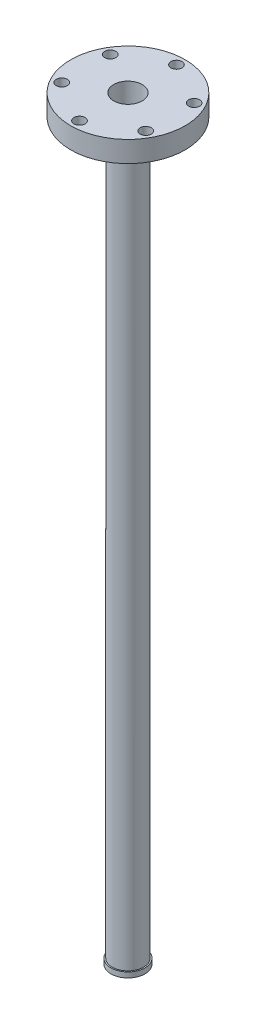
ISO-10303-21;
HEADER;
FILE_DESCRIPTION(('STEP AP214'),'2;1');
FILE_NAME('part.step','',(''),(''),'','','');
FILE_SCHEMA(('AUTOMOTIVE_DESIGN { 1 0 10303 214 1 1 1 1 }'));
ENDSEC;
DATA;
#1=APPLICATION_CONTEXT('core data for automotive mechanical design processes');
#2=APPLICATION_PROTOCOL_DEFINITION('international standard','automotive_design',2000,#1);
#3=PRODUCT_CONTEXT('',#1,'mechanical');
#4=PRODUCT('Part','Part','',(#3));
#5=PRODUCT_RELATED_PRODUCT_CATEGORY('part','',(#4));
#6=PRODUCT_DEFINITION_FORMATION('','',#4);
#7=PRODUCT_DEFINITION_CONTEXT('part definition',#1,'design');
#8=PRODUCT_DEFINITION('design','',#6,#7);
#9=PRODUCT_DEFINITION_SHAPE('','',#8);
#10=(LENGTH_UNIT() NAMED_UNIT(*) SI_UNIT(.MILLI.,.METRE.));
#11=(NAMED_UNIT(*) PLANE_ANGLE_UNIT() SI_UNIT($,.RADIAN.));
#12=(NAMED_UNIT(*) SI_UNIT($,.STERADIAN.) SOLID_ANGLE_UNIT());
#13=UNCERTAINTY_MEASURE_WITH_UNIT(LENGTH_MEASURE(1.E-05),#10,'distance_accuracy_value','');
#14=(GEOMETRIC_REPRESENTATION_CONTEXT(3) GLOBAL_UNCERTAINTY_ASSIGNED_CONTEXT((#13)) GLOBAL_UNIT_ASSIGNED_CONTEXT((#10,
#11,#12)) REPRESENTATION_CONTEXT('',''));
#15=CARTESIAN_POINT('',(0.,0.,0.));
#16=DIRECTION('',(0.,0.,1.));
#17=DIRECTION('',(1.,0.,0.));
#18=AXIS2_PLACEMENT_3D('',#15,#16,#17);
#19=CARTESIAN_POINT('',(0.,457.2,0.));
#20=DIRECTION('',(0.,-1.,0.));
#21=DIRECTION('',(0.,0.,-1.));
#22=AXIS2_PLACEMENT_3D('',#19,#20,#21);
#23=CYLINDRICAL_SURFACE('',#22,9.525);
#24=CARTESIAN_POINT('',(0.,444.5,0.));
#25=DIRECTION('',(0.,1.,0.));
#26=DIRECTION('',(0.,0.,1.));
#27=AXIS2_PLACEMENT_3D('',#24,#25,#26);
#28=CIRCLE('',#27,9.525);
#29=CARTESIAN_POINT('',(0.,444.5,9.525));
#30=VERTEX_POINT('',#29);
#31=EDGE_CURVE('E37',#30,#30,#28,.T.);
#32=ORIENTED_EDGE('',*,*,#31,.F.);
#33=EDGE_LOOP('',(#32));
#34=FACE_BOUND('',#33,.T.);
#35=CARTESIAN_POINT('',(0.,3.17499999999998,0.));
#36=DIRECTION('',(0.,-1.,0.));
#37=DIRECTION('',(0.,0.,-1.));
#38=AXIS2_PLACEMENT_3D('',#35,#36,#37);
#39=CIRCLE('',#38,9.525);
#40=CARTESIAN_POINT('',(0.,3.17499999999998,-9.525));
#41=VERTEX_POINT('',#40);
#42=EDGE_CURVE('E10',#41,#41,#39,.T.);
#43=ORIENTED_EDGE('',*,*,#42,.F.);
#44=EDGE_LOOP('',(#43));
#45=FACE_BOUND('',#44,.T.);
#46=ADVANCED_FACE('F30',(#34,#45),#23,.T.);
#47=CARTESIAN_POINT('',(0.,457.2,0.));
#48=DIRECTION('',(0.,1.,0.));
#49=DIRECTION('',(0.,0.,1.));
#50=AXIS2_PLACEMENT_3D('',#47,#48,#49);
#51=PLANE('',#50);
#52=CARTESIAN_POINT('',(-25.42858431608,457.2,-14.6812000000003));
#53=DIRECTION('',(0.,1.,0.));
#54=DIRECTION('',(0.866025403784433,0.,0.50000000000001));
#55=AXIS2_PLACEMENT_3D('',#52,#53,#54);
#56=CIRCLE('',#55,3.3655);
#57=CARTESIAN_POINT('',(-22.5139758196435,457.2,-12.9984500000003));
#58=VERTEX_POINT('',#57);
#59=EDGE_CURVE('E48',#58,#58,#56,.T.);
#60=ORIENTED_EDGE('',*,*,#59,.F.);
#61=EDGE_LOOP('',(#60));
#62=FACE_BOUND('',#61,.T.);
#63=CARTESIAN_POINT('',(-25.4285843160803,457.2,14.6811999999998));
#64=DIRECTION('',(0.,1.,0.));
#65=DIRECTION('',(0.866025403784443,0.,-0.499999999999992));
#66=AXIS2_PLACEMENT_3D('',#63,#64,#65);
#67=CIRCLE('',#66,3.3655);
#68=CARTESIAN_POINT('',(-22.5139758196438,457.2,12.9984499999998));
#69=VERTEX_POINT('',#68);
#70=EDGE_CURVE('E52',#69,#69,#67,.T.);
#71=ORIENTED_EDGE('',*,*,#70,.F.);
#72=EDGE_LOOP('',(#71));
#73=FACE_BOUND('',#72,.T.);
#74=CARTESIAN_POINT('',(-2.05036662084476E-13,457.2,29.3624));
#75=DIRECTION('',(0.,1.,0.));
#76=DIRECTION('',(0.,0.,-1.));
#77=AXIS2_PLACEMENT_3D('',#74,#75,#76);
#78=CIRCLE('',#77,3.3655);
#79=CARTESIAN_POINT('',(-1.81535487580849E-13,457.2,25.9969));
#80=VERTEX_POINT('',#79);
#81=EDGE_CURVE('E56',#80,#80,#78,.T.);
#82=ORIENTED_EDGE('',*,*,#81,.F.);
#83=EDGE_LOOP('',(#82));
#84=FACE_BOUND('',#83,.T.);
#85=CARTESIAN_POINT('',(25.4285843160801,457.2,14.6812000000001));
#86=DIRECTION('',(0.,1.,0.));
#87=DIRECTION('',(-0.866025403784436,0.,-0.500000000000004));
#88=AXIS2_PLACEMENT_3D('',#85,#86,#87);
#89=CIRCLE('',#88,3.3655);
#90=CARTESIAN_POINT('',(22.5139758196436,457.2,12.9984500000001));
#91=VERTEX_POINT('',#90);
#92=EDGE_CURVE('E60',#91,#91,#89,.T.);
#93=ORIENTED_EDGE('',*,*,#92,.F.);
#94=EDGE_LOOP('',(#93));
#95=FACE_BOUND('',#94,.T.);
#96=CARTESIAN_POINT('',(25.4285843160802,457.2,-14.6811999999999));
#97=DIRECTION('',(0.,1.,0.));
#98=DIRECTION('',(-0.86602540378444,0.,0.499999999999998));
#99=AXIS2_PLACEMENT_3D('',#96,#97,#98);
#100=CIRCLE('',#99,3.3655);
#101=CARTESIAN_POINT('',(22.5139758196437,457.2,-12.9984499999999));
#102=VERTEX_POINT('',#101);
#103=EDGE_CURVE('E64',#102,#102,#100,.T.);
#104=ORIENTED_EDGE('',*,*,#103,.F.);
#105=EDGE_LOOP('',(#104));
#106=FACE_BOUND('',#105,.T.);
#107=CARTESIAN_POINT('',(0.,457.2,-29.3624));
#108=DIRECTION('',(0.,1.,0.));
#109=DIRECTION('',(0.,0.,1.));
#110=AXIS2_PLACEMENT_3D('',#107,#108,#109);
#111=CIRCLE('',#110,3.3655);
#112=CARTESIAN_POINT('',(0.,457.2,-25.9969));
#113=VERTEX_POINT('',#112);
#114=EDGE_CURVE('E68',#113,#113,#111,.T.);
#115=ORIENTED_EDGE('',*,*,#114,.F.);
#116=EDGE_LOOP('',(#115));
#117=FACE_BOUND('',#116,.T.);
#118=CARTESIAN_POINT('',(0.,457.2,0.));
#119=DIRECTION('',(0.,1.,0.));
#120=DIRECTION('',(0.,0.,1.));
#121=AXIS2_PLACEMENT_3D('',#118,#119,#120);
#122=CIRCLE('',#121,8.636);
#123=CARTESIAN_POINT('',(0.,457.2,8.636));
#124=VERTEX_POINT('',#123);
#125=EDGE_CURVE('E42',#124,#124,#122,.T.);
#126=ORIENTED_EDGE('',*,*,#125,.F.);
#127=EDGE_LOOP('',(#126));
#128=FACE_BOUND('',#127,.T.);
#129=CARTESIAN_POINT('',(0.,457.2,0.));
#130=DIRECTION('',(0.,1.,0.));
#131=DIRECTION('',(0.,0.,1.));
#132=AXIS2_PLACEMENT_3D('',#129,#130,#131);
#133=CIRCLE('',#132,34.671);
#134=CARTESIAN_POINT('',(0.,457.2,34.671));
#135=VERTEX_POINT('',#134);
#136=EDGE_CURVE('E76',#135,#135,#133,.T.);
#137=ORIENTED_EDGE('',*,*,#136,.T.);
#138=EDGE_LOOP('',(#137));
#139=FACE_BOUND('',#138,.T.);
#140=ADVANCED_FACE('F113',(#62,#73,#84,#95,#106,#117,#128,#139),#51,.T.);
#141=CARTESIAN_POINT('',(0.,0.,0.));
#142=DIRECTION('',(0.,1.,0.));
#143=DIRECTION('',(0.,0.,1.));
#144=AXIS2_PLACEMENT_3D('',#141,#142,#143);
#145=PLANE('',#144);
#146=CARTESIAN_POINT('',(0.,0.,0.));
#147=DIRECTION('',(0.,1.,0.));
#148=DIRECTION('',(0.,0.,1.));
#149=AXIS2_PLACEMENT_3D('',#146,#147,#148);
#150=CIRCLE('',#149,8.636);
#151=CARTESIAN_POINT('',(0.,0.,8.636));
#152=VERTEX_POINT('',#151);
#153=EDGE_CURVE('E75',#152,#152,#150,.T.);
#154=ORIENTED_EDGE('',*,*,#153,.T.);
#155=EDGE_LOOP('',(#154));
#156=FACE_BOUND('',#155,.T.);
#157=CARTESIAN_POINT('',(0.,0.,0.));
#158=DIRECTION('',(0.,-1.,0.));
#159=DIRECTION('',(0.,0.,-1.));
#160=AXIS2_PLACEMENT_3D('',#157,#158,#159);
#161=CIRCLE('',#160,10.31875);
#162=CARTESIAN_POINT('',(0.,0.,-10.31875));
#163=VERTEX_POINT('',#162);
#164=EDGE_CURVE('E46',#163,#163,#161,.T.);
#165=ORIENTED_EDGE('',*,*,#164,.T.);
#166=EDGE_LOOP('',(#165));
#167=FACE_BOUND('',#166,.T.);
#168=ADVANCED_FACE('F118',(#156,#167),#145,.F.);
#169=CARTESIAN_POINT('',(0.,457.2,0.));
#170=DIRECTION('',(0.,-1.,0.));
#171=DIRECTION('',(0.,0.,-1.));
#172=AXIS2_PLACEMENT_3D('',#169,#170,#171);
#173=CYLINDRICAL_SURFACE('',#172,8.636);
#174=ORIENTED_EDGE('',*,*,#153,.F.);
#175=EDGE_LOOP('',(#174));
#176=FACE_BOUND('',#175,.T.);
#177=ORIENTED_EDGE('',*,*,#125,.T.);
#178=EDGE_LOOP('',(#177));
#179=FACE_BOUND('',#178,.T.);
#180=ADVANCED_FACE('F126',(#176,#179),#173,.F.);
#181=CARTESIAN_POINT('',(0.,444.5,0.));
#182=DIRECTION('',(0.,1.,0.));
#183=DIRECTION('',(0.,0.,1.));
#184=AXIS2_PLACEMENT_3D('',#181,#182,#183);
#185=PLANE('',#184);
#186=CARTESIAN_POINT('',(-25.42858431608,444.5,-14.6812000000003));
#187=DIRECTION('',(0.,1.,0.));
#188=DIRECTION('',(0.,0.,1.));
#189=AXIS2_PLACEMENT_3D('',#186,#187,#188);
#190=CIRCLE('',#189,3.3655);
#191=CARTESIAN_POINT('',(-25.42858431608,444.5,-11.3157000000003));
#192=VERTEX_POINT('',#191);
#193=EDGE_CURVE('E33',#192,#192,#190,.T.);
#194=ORIENTED_EDGE('',*,*,#193,.T.);
#195=EDGE_LOOP('',(#194));
#196=FACE_BOUND('',#195,.T.);
#197=CARTESIAN_POINT('',(-25.4285843160803,444.5,14.6811999999998));
#198=DIRECTION('',(0.,1.,0.));
#199=DIRECTION('',(0.,0.,1.));
#200=AXIS2_PLACEMENT_3D('',#197,#198,#199);
#201=CIRCLE('',#200,3.3655);
#202=CARTESIAN_POINT('',(-25.4285843160803,444.5,18.0466999999998));
#203=VERTEX_POINT('',#202);
#204=EDGE_CURVE('E55',#203,#203,#201,.T.);
#205=ORIENTED_EDGE('',*,*,#204,.T.);
#206=EDGE_LOOP('',(#205));
#207=FACE_BOUND('',#206,.T.);
#208=CARTESIAN_POINT('',(-2.05036662084476E-13,444.5,29.3624));
#209=DIRECTION('',(0.,1.,0.));
#210=DIRECTION('',(0.,0.,1.));
#211=AXIS2_PLACEMENT_3D('',#208,#209,#210);
#212=CIRCLE('',#211,3.3655);
#213=CARTESIAN_POINT('',(-2.05036662084476E-13,444.5,32.7279));
#214=VERTEX_POINT('',#213);
#215=EDGE_CURVE('E59',#214,#214,#212,.T.);
#216=ORIENTED_EDGE('',*,*,#215,.T.);
#217=EDGE_LOOP('',(#216));
#218=FACE_BOUND('',#217,.T.);
#219=CARTESIAN_POINT('',(25.4285843160801,444.5,14.6812000000001));
#220=DIRECTION('',(0.,1.,0.));
#221=DIRECTION('',(0.,0.,1.));
#222=AXIS2_PLACEMENT_3D('',#219,#220,#221);
#223=CIRCLE('',#222,3.3655);
#224=CARTESIAN_POINT('',(25.4285843160801,444.5,18.0467000000001));
#225=VERTEX_POINT('',#224);
#226=EDGE_CURVE('E63',#225,#225,#223,.T.);
#227=ORIENTED_EDGE('',*,*,#226,.T.);
#228=EDGE_LOOP('',(#227));
#229=FACE_BOUND('',#228,.T.);
#230=CARTESIAN_POINT('',(25.4285843160802,444.5,-14.6811999999999));
#231=DIRECTION('',(0.,1.,0.));
#232=DIRECTION('',(0.,0.,1.));
#233=AXIS2_PLACEMENT_3D('',#230,#231,#232);
#234=CIRCLE('',#233,3.3655);
#235=CARTESIAN_POINT('',(25.4285843160802,444.5,-11.3156999999999));
#236=VERTEX_POINT('',#235);
#237=EDGE_CURVE('E67',#236,#236,#234,.T.);
#238=ORIENTED_EDGE('',*,*,#237,.T.);
#239=EDGE_LOOP('',(#238));
#240=FACE_BOUND('',#239,.T.);
#241=CARTESIAN_POINT('',(0.,444.5,-29.3624));
#242=DIRECTION('',(0.,1.,0.));
#243=DIRECTION('',(0.,0.,1.));
#244=AXIS2_PLACEMENT_3D('',#241,#242,#243);
#245=CIRCLE('',#244,3.3655);
#246=CARTESIAN_POINT('',(0.,444.5,-25.9969));
#247=VERTEX_POINT('',#246);
#248=EDGE_CURVE('E71',#247,#247,#245,.T.);
#249=ORIENTED_EDGE('',*,*,#248,.T.);
#250=EDGE_LOOP('',(#249));
#251=FACE_BOUND('',#250,.T.);
#252=CARTESIAN_POINT('',(0.,444.5,0.));
#253=DIRECTION('',(0.,1.,0.));
#254=DIRECTION('',(0.,0.,1.));
#255=AXIS2_PLACEMENT_3D('',#252,#253,#254);
#256=CIRCLE('',#255,34.671);
#257=CARTESIAN_POINT('',(0.,444.5,34.671));
#258=VERTEX_POINT('',#257);
#259=EDGE_CURVE('E72',#258,#258,#256,.T.);
#260=ORIENTED_EDGE('',*,*,#259,.F.);
#261=EDGE_LOOP('',(#260));
#262=FACE_BOUND('',#261,.T.);
#263=ORIENTED_EDGE('',*,*,#31,.T.);
#264=EDGE_LOOP('',(#263));
#265=FACE_BOUND('',#264,.T.);
#266=ADVANCED_FACE('F93',(#196,#207,#218,#229,#240,#251,#262,#265),#185,.F.);
#267=CARTESIAN_POINT('',(0.,444.5,0.));
#268=DIRECTION('',(0.,1.,0.));
#269=DIRECTION('',(0.,0.,1.));
#270=AXIS2_PLACEMENT_3D('',#267,#268,#269);
#271=CYLINDRICAL_SURFACE('',#270,34.671);
#272=ORIENTED_EDGE('',*,*,#259,.T.);
#273=EDGE_LOOP('',(#272));
#274=FACE_BOUND('',#273,.T.);
#275=ORIENTED_EDGE('',*,*,#136,.F.);
#276=EDGE_LOOP('',(#275));
#277=FACE_BOUND('',#276,.T.);
#278=ADVANCED_FACE('F125',(#274,#277),#271,.T.);
#279=CARTESIAN_POINT('',(0.,0.,-29.3624));
#280=DIRECTION('',(0.,1.,0.));
#281=DIRECTION('',(0.,0.,1.));
#282=AXIS2_PLACEMENT_3D('',#279,#280,#281);
#283=CYLINDRICAL_SURFACE('',#282,3.3655);
#284=ORIENTED_EDGE('',*,*,#114,.T.);
#285=EDGE_LOOP('',(#284));
#286=FACE_BOUND('',#285,.T.);
#287=ORIENTED_EDGE('',*,*,#248,.F.);
#288=EDGE_LOOP('',(#287));
#289=FACE_BOUND('',#288,.T.);
#290=ADVANCED_FACE('F133',(#286,#289),#283,.F.);
#291=CARTESIAN_POINT('',(25.4285843160802,0.,-14.6811999999999));
#292=DIRECTION('',(0.,1.,0.));
#293=DIRECTION('',(0.,0.,1.));
#294=AXIS2_PLACEMENT_3D('',#291,#292,#293);
#295=CYLINDRICAL_SURFACE('',#294,3.3655);
#296=ORIENTED_EDGE('',*,*,#103,.T.);
#297=EDGE_LOOP('',(#296));
#298=FACE_BOUND('',#297,.T.);
#299=ORIENTED_EDGE('',*,*,#237,.F.);
#300=EDGE_LOOP('',(#299));
#301=FACE_BOUND('',#300,.T.);
#302=ADVANCED_FACE('F208',(#298,#301),#295,.F.);
#303=CARTESIAN_POINT('',(25.4285843160801,0.,14.6812000000001));
#304=DIRECTION('',(0.,1.,0.));
#305=DIRECTION('',(0.,0.,1.));
#306=AXIS2_PLACEMENT_3D('',#303,#304,#305);
#307=CYLINDRICAL_SURFACE('',#306,3.3655);
#308=ORIENTED_EDGE('',*,*,#92,.T.);
#309=EDGE_LOOP('',(#308));
#310=FACE_BOUND('',#309,.T.);
#311=ORIENTED_EDGE('',*,*,#226,.F.);
#312=EDGE_LOOP('',(#311));
#313=FACE_BOUND('',#312,.T.);
#314=ADVANCED_FACE('F109',(#310,#313),#307,.F.);
#315=CARTESIAN_POINT('',(-2.05036662084476E-13,0.,29.3624));
#316=DIRECTION('',(0.,1.,0.));
#317=DIRECTION('',(0.,0.,1.));
#318=AXIS2_PLACEMENT_3D('',#315,#316,#317);
#319=CYLINDRICAL_SURFACE('',#318,3.3655);
#320=ORIENTED_EDGE('',*,*,#81,.T.);
#321=EDGE_LOOP('',(#320));
#322=FACE_BOUND('',#321,.T.);
#323=ORIENTED_EDGE('',*,*,#215,.F.);
#324=EDGE_LOOP('',(#323));
#325=FACE_BOUND('',#324,.T.);
#326=ADVANCED_FACE('F99',(#322,#325),#319,.F.);
#327=CARTESIAN_POINT('',(-25.4285843160803,0.,14.6811999999998));
#328=DIRECTION('',(0.,1.,0.));
#329=DIRECTION('',(0.,0.,1.));
#330=AXIS2_PLACEMENT_3D('',#327,#328,#329);
#331=CYLINDRICAL_SURFACE('',#330,3.3655);
#332=ORIENTED_EDGE('',*,*,#70,.T.);
#333=EDGE_LOOP('',(#332));
#334=FACE_BOUND('',#333,.T.);
#335=ORIENTED_EDGE('',*,*,#204,.F.);
#336=EDGE_LOOP('',(#335));
#337=FACE_BOUND('',#336,.T.);
#338=ADVANCED_FACE('F96',(#334,#337),#331,.F.);
#339=CARTESIAN_POINT('',(-25.42858431608,0.,-14.6812000000003));
#340=DIRECTION('',(0.,1.,0.));
#341=DIRECTION('',(0.,0.,1.));
#342=AXIS2_PLACEMENT_3D('',#339,#340,#341);
#343=CYLINDRICAL_SURFACE('',#342,3.3655);
#344=ORIENTED_EDGE('',*,*,#59,.T.);
#345=EDGE_LOOP('',(#344));
#346=FACE_BOUND('',#345,.T.);
#347=ORIENTED_EDGE('',*,*,#193,.F.);
#348=EDGE_LOOP('',(#347));
#349=FACE_BOUND('',#348,.T.);
#350=ADVANCED_FACE('F98',(#346,#349),#343,.F.);
#351=CARTESIAN_POINT('',(0.,3.175,0.));
#352=DIRECTION('',(0.,-1.,0.));
#353=DIRECTION('',(0.,0.,-1.));
#354=AXIS2_PLACEMENT_3D('',#351,#352,#353);
#355=PLANE('',#354);
#356=CARTESIAN_POINT('',(0.,3.175,0.));
#357=DIRECTION('',(0.,-1.,0.));
#358=DIRECTION('',(0.,0.,-1.));
#359=AXIS2_PLACEMENT_3D('',#356,#357,#358);
#360=CIRCLE('',#359,10.31875);
#361=CARTESIAN_POINT('',(0.,3.175,-10.31875));
#362=VERTEX_POINT('',#361);
#363=EDGE_CURVE('E51',#362,#362,#360,.T.);
#364=ORIENTED_EDGE('',*,*,#363,.F.);
#365=EDGE_LOOP('',(#364));
#366=FACE_BOUND('',#365,.T.);
#367=ORIENTED_EDGE('',*,*,#42,.T.);
#368=EDGE_LOOP('',(#367));
#369=FACE_BOUND('',#368,.T.);
#370=ADVANCED_FACE('F106',(#366,#369),#355,.F.);
#371=CARTESIAN_POINT('',(0.,3.175,0.));
#372=DIRECTION('',(0.,-1.,0.));
#373=DIRECTION('',(0.,0.,-1.));
#374=AXIS2_PLACEMENT_3D('',#371,#372,#373);
#375=CYLINDRICAL_SURFACE('',#374,10.31875);
#376=ORIENTED_EDGE('',*,*,#363,.T.);
#377=EDGE_LOOP('',(#376));
#378=FACE_BOUND('',#377,.T.);
#379=ORIENTED_EDGE('',*,*,#164,.F.);
#380=EDGE_LOOP('',(#379));
#381=FACE_BOUND('',#380,.T.);
#382=ADVANCED_FACE('F153',(#378,#381),#375,.T.);
#383=CLOSED_SHELL('',(#46,#140,#168,#180,#266,#278,#290,#302,#314,#326,#338,#350,#370,#382));
#384=MANIFOLD_SOLID_BREP('B2',#383);
#385=ADVANCED_BREP_SHAPE_REPRESENTATION('',(#18,#384),#14);
#386=SHAPE_DEFINITION_REPRESENTATION(#9,#385);
ENDSEC;
END-ISO-10303-21;
